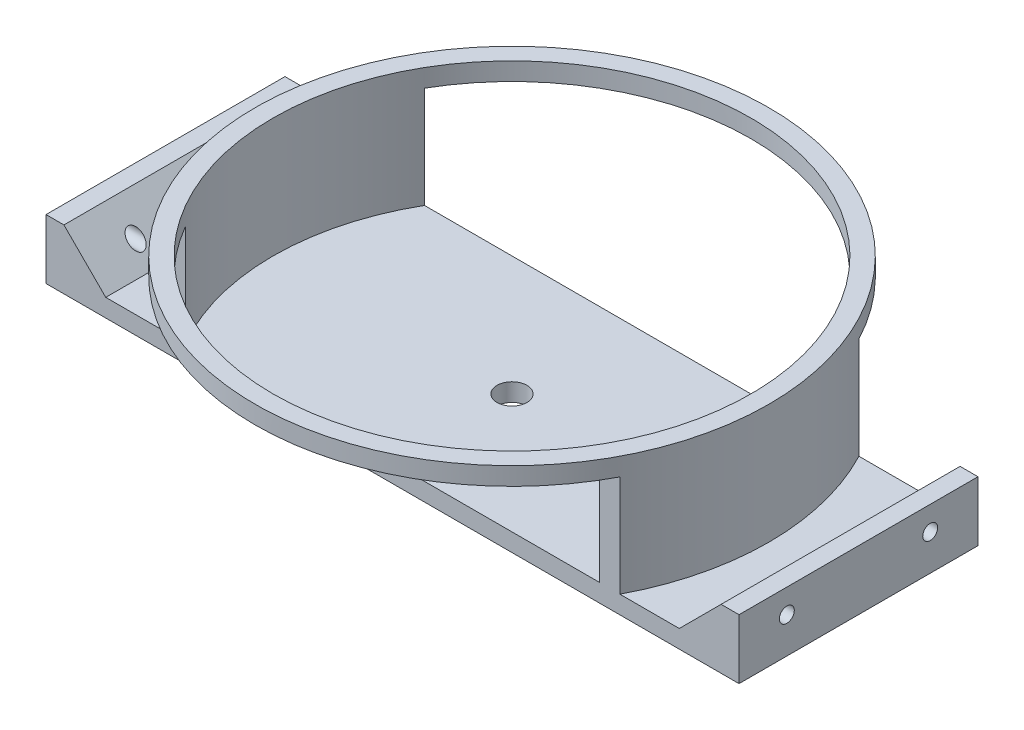
ISO-10303-21;
HEADER;
FILE_DESCRIPTION(('STEP AP214'),'2;1');
FILE_NAME('part.step','',(''),(''),'','','');
FILE_SCHEMA(('AUTOMOTIVE_DESIGN { 1 0 10303 214 1 1 1 1 }'));
ENDSEC;
DATA;
#1=APPLICATION_CONTEXT('core data for automotive mechanical design processes');
#2=APPLICATION_PROTOCOL_DEFINITION('international standard','automotive_design',2000,#1);
#3=PRODUCT_CONTEXT('',#1,'mechanical');
#4=PRODUCT('Part','Part','',(#3));
#5=PRODUCT_RELATED_PRODUCT_CATEGORY('part','',(#4));
#6=PRODUCT_DEFINITION_FORMATION('','',#4);
#7=PRODUCT_DEFINITION_CONTEXT('part definition',#1,'design');
#8=PRODUCT_DEFINITION('design','',#6,#7);
#9=PRODUCT_DEFINITION_SHAPE('','',#8);
#10=(LENGTH_UNIT() NAMED_UNIT(*) SI_UNIT(.MILLI.,.METRE.));
#11=(NAMED_UNIT(*) PLANE_ANGLE_UNIT() SI_UNIT($,.RADIAN.));
#12=(NAMED_UNIT(*) SI_UNIT($,.STERADIAN.) SOLID_ANGLE_UNIT());
#13=UNCERTAINTY_MEASURE_WITH_UNIT(LENGTH_MEASURE(1.E-05),#10,'distance_accuracy_value','');
#14=(GEOMETRIC_REPRESENTATION_CONTEXT(3) GLOBAL_UNCERTAINTY_ASSIGNED_CONTEXT((#13)) GLOBAL_UNIT_ASSIGNED_CONTEXT((#10,
#11,#12)) REPRESENTATION_CONTEXT('',''));
#15=CARTESIAN_POINT('',(0.,0.,0.));
#16=DIRECTION('',(0.,0.,1.));
#17=DIRECTION('',(1.,0.,0.));
#18=AXIS2_PLACEMENT_3D('',#15,#16,#17);
#19=CARTESIAN_POINT('',(0.,3.,0.));
#20=DIRECTION('',(0.,1.,0.));
#21=DIRECTION('',(0.,0.,1.));
#22=AXIS2_PLACEMENT_3D('',#19,#20,#21);
#23=PLANE('',#22);
#24=DIRECTION('',(-1.,0.,0.));
#25=VECTOR('',#24,1.);
#26=CARTESIAN_POINT('',(-58.,3.,-20.));
#27=LINE('',#26,#25);
#28=CARTESIAN_POINT('',(48.,3.,-20.));
#29=VERTEX_POINT('',#28);
#30=CARTESIAN_POINT('',(38.0657326213486,3.,-20.));
#31=VERTEX_POINT('',#30);
#32=EDGE_CURVE('E71',#29,#31,#27,.T.);
#33=ORIENTED_EDGE('',*,*,#32,.T.);
#34=CARTESIAN_POINT('',(0.,3.,0.));
#35=DIRECTION('',(0.,1.,0.));
#36=DIRECTION('',(0.,0.,1.));
#37=AXIS2_PLACEMENT_3D('',#34,#35,#36);
#38=CIRCLE('',#37,43.);
#39=CARTESIAN_POINT('',(38.0657326213486,3.,20.));
#40=VERTEX_POINT('',#39);
#41=EDGE_CURVE('E179',#40,#31,#38,.T.);
#42=ORIENTED_EDGE('',*,*,#41,.F.);
#43=DIRECTION('',(1.,0.,0.));
#44=VECTOR('',#43,1.);
#45=CARTESIAN_POINT('',(-58.,3.,20.));
#46=LINE('',#45,#44);
#47=CARTESIAN_POINT('',(48.,3.,20.));
#48=VERTEX_POINT('',#47);
#49=EDGE_CURVE('E278',#40,#48,#46,.T.);
#50=ORIENTED_EDGE('',*,*,#49,.T.);
#51=DIRECTION('',(0.,0.,-1.));
#52=VECTOR('',#51,1.);
#53=CARTESIAN_POINT('',(48.,3.,0.));
#54=LINE('',#53,#52);
#55=EDGE_CURVE('E304',#48,#29,#54,.T.);
#56=ORIENTED_EDGE('',*,*,#55,.T.);
#57=EDGE_LOOP('',(#33,#42,#50,#56));
#58=FACE_BOUND('',#57,.T.);
#59=ADVANCED_FACE('F45',(#58),#23,.T.);
#60=CARTESIAN_POINT('',(0.,20.,0.));
#61=DIRECTION('',(0.,1.,0.));
#62=DIRECTION('',(0.,0.,1.));
#63=AXIS2_PLACEMENT_3D('',#60,#61,#62);
#64=PLANE('',#63);
#65=DIRECTION('',(1.,0.,0.));
#66=VECTOR('',#65,1.);
#67=CARTESIAN_POINT('',(0.,20.,20.));
#68=LINE('',#67,#66);
#69=CARTESIAN_POINT('',(34.6410161513775,20.,20.));
#70=VERTEX_POINT('',#69);
#71=CARTESIAN_POINT('',(38.0657326213486,20.,20.));
#72=VERTEX_POINT('',#71);
#73=EDGE_CURVE('E187',#70,#72,#68,.T.);
#74=ORIENTED_EDGE('',*,*,#73,.T.);
#75=CARTESIAN_POINT('',(0.,20.,0.));
#76=DIRECTION('',(0.,1.,0.));
#77=DIRECTION('',(1.,0.,0.));
#78=AXIS2_PLACEMENT_3D('',#75,#76,#77);
#79=CIRCLE('',#78,43.);
#80=CARTESIAN_POINT('',(-38.0657326213486,20.,20.));
#81=VERTEX_POINT('',#80);
#82=EDGE_CURVE('E171',#81,#72,#79,.T.);
#83=ORIENTED_EDGE('',*,*,#82,.F.);
#84=DIRECTION('',(1.,0.,0.));
#85=VECTOR('',#84,1.);
#86=CARTESIAN_POINT('',(0.,20.,20.));
#87=LINE('',#86,#85);
#88=CARTESIAN_POINT('',(-34.6410161513775,20.,20.));
#89=VERTEX_POINT('',#88);
#90=EDGE_CURVE('E216',#81,#89,#87,.T.);
#91=ORIENTED_EDGE('',*,*,#90,.T.);
#92=CARTESIAN_POINT('',(0.,20.,0.));
#93=DIRECTION('',(0.,1.,0.));
#94=DIRECTION('',(0.,0.,1.));
#95=AXIS2_PLACEMENT_3D('',#92,#93,#94);
#96=CIRCLE('',#95,40.);
#97=EDGE_CURVE('E201',#89,#70,#96,.T.);
#98=ORIENTED_EDGE('',*,*,#97,.T.);
#99=EDGE_LOOP('',(#74,#83,#91,#98));
#100=FACE_BOUND('',#99,.T.);
#101=ADVANCED_FACE('F339',(#100),#64,.F.);
#102=DIRECTION('',(-1.,0.,0.));
#103=VECTOR('',#102,1.);
#104=CARTESIAN_POINT('',(0.,20.,-20.));
#105=LINE('',#104,#103);
#106=CARTESIAN_POINT('',(38.0657326213486,20.,-20.));
#107=VERTEX_POINT('',#106);
#108=CARTESIAN_POINT('',(34.6410161513775,20.,-20.));
#109=VERTEX_POINT('',#108);
#110=EDGE_CURVE('E164',#107,#109,#105,.T.);
#111=ORIENTED_EDGE('',*,*,#110,.T.);
#112=CARTESIAN_POINT('',(-34.6410161513775,20.,-20.));
#113=VERTEX_POINT('',#112);
#114=EDGE_CURVE('E190',#109,#113,#96,.T.);
#115=ORIENTED_EDGE('',*,*,#114,.T.);
#116=DIRECTION('',(-1.,0.,0.));
#117=VECTOR('',#116,1.);
#118=CARTESIAN_POINT('',(0.,20.,-20.));
#119=LINE('',#118,#117);
#120=CARTESIAN_POINT('',(-38.0657326213486,20.,-20.));
#121=VERTEX_POINT('',#120);
#122=EDGE_CURVE('E167',#113,#121,#119,.T.);
#123=ORIENTED_EDGE('',*,*,#122,.T.);
#124=EDGE_CURVE('E160',#107,#121,#79,.T.);
#125=ORIENTED_EDGE('',*,*,#124,.F.);
#126=EDGE_LOOP('',(#111,#115,#123,#125));
#127=FACE_BOUND('',#126,.T.);
#128=ADVANCED_FACE('F162',(#127),#64,.F.);
#129=CARTESIAN_POINT('',(-48.,3.,20.));
#130=VERTEX_POINT('',#129);
#131=CARTESIAN_POINT('',(-38.0657326213486,3.,20.));
#132=VERTEX_POINT('',#131);
#133=EDGE_CURVE('E281',#130,#132,#46,.T.);
#134=ORIENTED_EDGE('',*,*,#133,.T.);
#135=CARTESIAN_POINT('',(0.,3.,0.));
#136=DIRECTION('',(0.,1.,0.));
#137=DIRECTION('',(0.,0.,1.));
#138=AXIS2_PLACEMENT_3D('',#135,#136,#137);
#139=CIRCLE('',#138,43.);
#140=CARTESIAN_POINT('',(-38.0657326213486,3.,-20.));
#141=VERTEX_POINT('',#140);
#142=EDGE_CURVE('E207',#141,#132,#139,.T.);
#143=ORIENTED_EDGE('',*,*,#142,.F.);
#144=CARTESIAN_POINT('',(-48.0000000000001,3.,-20.));
#145=VERTEX_POINT('',#144);
#146=EDGE_CURVE('E280',#141,#145,#27,.T.);
#147=ORIENTED_EDGE('',*,*,#146,.T.);
#148=DIRECTION('',(0.,0.,1.));
#149=VECTOR('',#148,1.);
#150=CARTESIAN_POINT('',(-48.0000000000001,3.,0.));
#151=LINE('',#150,#149);
#152=EDGE_CURVE('E306',#145,#130,#151,.T.);
#153=ORIENTED_EDGE('',*,*,#152,.T.);
#154=EDGE_LOOP('',(#134,#143,#147,#153));
#155=FACE_BOUND('',#154,.T.);
#156=ADVANCED_FACE('F341',(#155),#23,.T.);
#157=CARTESIAN_POINT('',(0.,3.,0.));
#158=DIRECTION('',(0.,1.,0.));
#159=DIRECTION('',(0.,0.,1.));
#160=AXIS2_PLACEMENT_3D('',#157,#158,#159);
#161=CIRCLE('',#160,40.);
#162=CARTESIAN_POINT('',(34.6410161513775,3.,20.));
#163=VERTEX_POINT('',#162);
#164=CARTESIAN_POINT('',(34.6410161513775,3.,-20.));
#165=VERTEX_POINT('',#164);
#166=EDGE_CURVE('E63',#163,#165,#161,.T.);
#167=ORIENTED_EDGE('',*,*,#166,.T.);
#168=CARTESIAN_POINT('',(-34.6410161513775,3.,-20.));
#169=VERTEX_POINT('',#168);
#170=EDGE_CURVE('E279',#165,#169,#27,.T.);
#171=ORIENTED_EDGE('',*,*,#170,.T.);
#172=CARTESIAN_POINT('',(0.,3.,0.));
#173=DIRECTION('',(0.,1.,0.));
#174=DIRECTION('',(0.,0.,1.));
#175=AXIS2_PLACEMENT_3D('',#172,#173,#174);
#176=CIRCLE('',#175,40.);
#177=CARTESIAN_POINT('',(-34.6410161513775,3.,20.));
#178=VERTEX_POINT('',#177);
#179=EDGE_CURVE('E212',#169,#178,#176,.T.);
#180=ORIENTED_EDGE('',*,*,#179,.T.);
#181=EDGE_CURVE('E284',#178,#163,#46,.T.);
#182=ORIENTED_EDGE('',*,*,#181,.T.);
#183=EDGE_LOOP('',(#167,#171,#180,#182));
#184=FACE_BOUND('',#183,.T.);
#185=CARTESIAN_POINT('',(0.,3.,0.));
#186=DIRECTION('',(0.,1.,0.));
#187=DIRECTION('',(0.,0.,1.));
#188=AXIS2_PLACEMENT_3D('',#185,#186,#187);
#189=CIRCLE('',#188,2.5);
#190=CARTESIAN_POINT('',(0.,3.,2.5));
#191=VERTEX_POINT('',#190);
#192=EDGE_CURVE('E270',#191,#191,#189,.T.);
#193=ORIENTED_EDGE('',*,*,#192,.F.);
#194=EDGE_LOOP('',(#193));
#195=FACE_BOUND('',#194,.T.);
#196=ADVANCED_FACE('F342',(#184,#195),#23,.T.);
#197=CARTESIAN_POINT('',(58.,3.,-20.));
#198=DIRECTION('',(-1.,0.,0.));
#199=DIRECTION('',(0.,0.,1.));
#200=AXIS2_PLACEMENT_3D('',#197,#198,#199);
#201=PLANE('',#200);
#202=CARTESIAN_POINT('',(58.,6.,-12.));
#203=DIRECTION('',(-1.,0.,0.));
#204=DIRECTION('',(0.,0.,1.));
#205=AXIS2_PLACEMENT_3D('',#202,#203,#204);
#206=CIRCLE('',#205,1.25);
#207=CARTESIAN_POINT('',(58.,6.,-10.75));
#208=VERTEX_POINT('',#207);
#209=EDGE_CURVE('E228',#208,#208,#206,.T.);
#210=ORIENTED_EDGE('',*,*,#209,.T.);
#211=EDGE_LOOP('',(#210));
#212=FACE_BOUND('',#211,.T.);
#213=CARTESIAN_POINT('',(58.,6.,12.));
#214=DIRECTION('',(-1.,0.,0.));
#215=DIRECTION('',(0.,0.,1.));
#216=AXIS2_PLACEMENT_3D('',#213,#214,#215);
#217=CIRCLE('',#216,1.25);
#218=CARTESIAN_POINT('',(58.,6.,13.25));
#219=VERTEX_POINT('',#218);
#220=EDGE_CURVE('E219',#219,#219,#217,.T.);
#221=ORIENTED_EDGE('',*,*,#220,.T.);
#222=EDGE_LOOP('',(#221));
#223=FACE_BOUND('',#222,.T.);
#224=DIRECTION('',(0.,0.,-1.));
#225=VECTOR('',#224,1.);
#226=CARTESIAN_POINT('',(58.,0.,-20.));
#227=LINE('',#226,#225);
#228=CARTESIAN_POINT('',(58.,0.,20.));
#229=VERTEX_POINT('',#228);
#230=CARTESIAN_POINT('',(58.,0.,-20.));
#231=VERTEX_POINT('',#230);
#232=EDGE_CURVE('E274',#229,#231,#227,.T.);
#233=ORIENTED_EDGE('',*,*,#232,.T.);
#234=DIRECTION('',(0.,-1.,0.));
#235=VECTOR('',#234,1.);
#236=CARTESIAN_POINT('',(58.,3.,-20.));
#237=LINE('',#236,#235);
#238=CARTESIAN_POINT('',(58.,10.,-20.));
#239=VERTEX_POINT('',#238);
#240=EDGE_CURVE('E301',#239,#231,#237,.T.);
#241=ORIENTED_EDGE('',*,*,#240,.F.);
#242=DIRECTION('',(0.,0.,-1.));
#243=VECTOR('',#242,1.);
#244=CARTESIAN_POINT('',(58.,10.,-20.));
#245=LINE('',#244,#243);
#246=CARTESIAN_POINT('',(58.,10.,20.));
#247=VERTEX_POINT('',#246);
#248=EDGE_CURVE('E246',#247,#239,#245,.T.);
#249=ORIENTED_EDGE('',*,*,#248,.F.);
#250=DIRECTION('',(0.,-1.,0.));
#251=VECTOR('',#250,1.);
#252=CARTESIAN_POINT('',(58.,3.,20.));
#253=LINE('',#252,#251);
#254=EDGE_CURVE('E283',#247,#229,#253,.T.);
#255=ORIENTED_EDGE('',*,*,#254,.T.);
#256=EDGE_LOOP('',(#233,#241,#249,#255));
#257=FACE_BOUND('',#256,.T.);
#258=ADVANCED_FACE('F355',(#212,#223,#257),#201,.F.);
#259=CARTESIAN_POINT('',(-58.,3.,-20.));
#260=DIRECTION('',(0.,0.,1.));
#261=DIRECTION('',(1.,0.,0.));
#262=AXIS2_PLACEMENT_3D('',#259,#260,#261);
#263=PLANE('',#262);
#264=DIRECTION('',(-1.,0.,0.));
#265=VECTOR('',#264,1.);
#266=CARTESIAN_POINT('',(-58.,0.,-20.));
#267=LINE('',#266,#265);
#268=CARTESIAN_POINT('',(-58.,0.,-20.));
#269=VERTEX_POINT('',#268);
#270=EDGE_CURVE('E287',#231,#269,#267,.T.);
#271=ORIENTED_EDGE('',*,*,#270,.T.);
#272=DIRECTION('',(0.,-1.,0.));
#273=VECTOR('',#272,1.);
#274=CARTESIAN_POINT('',(-58.,3.,-20.));
#275=LINE('',#274,#273);
#276=CARTESIAN_POINT('',(-58.,10.,-20.));
#277=VERTEX_POINT('',#276);
#278=EDGE_CURVE('E298',#277,#269,#275,.T.);
#279=ORIENTED_EDGE('',*,*,#278,.F.);
#280=DIRECTION('',(-1.,0.,0.));
#281=VECTOR('',#280,1.);
#282=CARTESIAN_POINT('',(-58.,10.,-20.));
#283=LINE('',#282,#281);
#284=CARTESIAN_POINT('',(-55.,10.,-20.));
#285=VERTEX_POINT('',#284);
#286=EDGE_CURVE('E267',#285,#277,#283,.T.);
#287=ORIENTED_EDGE('',*,*,#286,.F.);
#288=DIRECTION('',(0.707106781186546,-0.707106781186549,0.));
#289=VECTOR('',#288,1.);
#290=CARTESIAN_POINT('',(-53.,7.99999999999998,-20.));
#291=LINE('',#290,#289);
#292=EDGE_CURVE('E308',#285,#145,#291,.T.);
#293=ORIENTED_EDGE('',*,*,#292,.T.);
#294=ORIENTED_EDGE('',*,*,#146,.F.);
#295=DIRECTION('',(0.,-1.,0.));
#296=VECTOR('',#295,1.);
#297=CARTESIAN_POINT('',(-38.0657326213486,60.8640748210642,-20.));
#298=LINE('',#297,#296);
#299=EDGE_CURVE('E211',#121,#141,#298,.T.);
#300=ORIENTED_EDGE('',*,*,#299,.F.);
#301=ORIENTED_EDGE('',*,*,#122,.F.);
#302=DIRECTION('',(0.,-1.,0.));
#303=VECTOR('',#302,1.);
#304=CARTESIAN_POINT('',(-34.6410161513775,60.8640748210642,-20.));
#305=LINE('',#304,#303);
#306=EDGE_CURVE('E220',#113,#169,#305,.T.);
#307=ORIENTED_EDGE('',*,*,#306,.T.);
#308=ORIENTED_EDGE('',*,*,#170,.F.);
#309=DIRECTION('',(0.,-1.,0.));
#310=VECTOR('',#309,1.);
#311=CARTESIAN_POINT('',(34.6410161513775,60.8640748210642,-20.));
#312=LINE('',#311,#310);
#313=EDGE_CURVE('E185',#109,#165,#312,.T.);
#314=ORIENTED_EDGE('',*,*,#313,.F.);
#315=ORIENTED_EDGE('',*,*,#110,.F.);
#316=DIRECTION('',(0.,-1.,0.));
#317=VECTOR('',#316,1.);
#318=CARTESIAN_POINT('',(38.0657326213486,60.8640748210642,-20.));
#319=LINE('',#318,#317);
#320=EDGE_CURVE('E175',#107,#31,#319,.T.);
#321=ORIENTED_EDGE('',*,*,#320,.T.);
#322=ORIENTED_EDGE('',*,*,#32,.F.);
#323=DIRECTION('',(0.707106781186546,0.707106781186549,0.));
#324=VECTOR('',#323,1.);
#325=CARTESIAN_POINT('',(-4.99999999999974,-50.,-20.));
#326=LINE('',#325,#324);
#327=CARTESIAN_POINT('',(55.,10.,-20.));
#328=VERTEX_POINT('',#327);
#329=EDGE_CURVE('E12',#29,#328,#326,.T.);
#330=ORIENTED_EDGE('',*,*,#329,.T.);
#331=DIRECTION('',(-1.,0.,0.));
#332=VECTOR('',#331,1.);
#333=CARTESIAN_POINT('',(58.,10.,-20.));
#334=LINE('',#333,#332);
#335=EDGE_CURVE('E249',#239,#328,#334,.T.);
#336=ORIENTED_EDGE('',*,*,#335,.F.);
#337=ORIENTED_EDGE('',*,*,#240,.T.);
#338=EDGE_LOOP('',(#271,#279,#287,#293,#294,#300,#301,#307,#308,#314,#315,#321,#322,#330,#336,#337));
#339=FACE_BOUND('',#338,.T.);
#340=ADVANCED_FACE('F183',(#339),#263,.F.);
#341=CARTESIAN_POINT('',(-58.,3.,-20.));
#342=DIRECTION('',(1.,0.,0.));
#343=DIRECTION('',(0.,0.,-1.));
#344=AXIS2_PLACEMENT_3D('',#341,#342,#343);
#345=PLANE('',#344);
#346=CARTESIAN_POINT('',(-58.,6.,-12.));
#347=DIRECTION('',(1.,0.,0.));
#348=DIRECTION('',(0.,0.,-1.));
#349=AXIS2_PLACEMENT_3D('',#346,#347,#348);
#350=CIRCLE('',#349,1.25);
#351=CARTESIAN_POINT('',(-58.,6.,-13.25));
#352=VERTEX_POINT('',#351);
#353=EDGE_CURVE('E243',#352,#352,#350,.T.);
#354=ORIENTED_EDGE('',*,*,#353,.T.);
#355=EDGE_LOOP('',(#354));
#356=FACE_BOUND('',#355,.T.);
#357=CARTESIAN_POINT('',(-58.,6.,12.));
#358=DIRECTION('',(1.,0.,0.));
#359=DIRECTION('',(0.,0.,-1.));
#360=AXIS2_PLACEMENT_3D('',#357,#358,#359);
#361=CIRCLE('',#360,1.25);
#362=CARTESIAN_POINT('',(-58.,6.,10.75));
#363=VERTEX_POINT('',#362);
#364=EDGE_CURVE('E237',#363,#363,#361,.T.);
#365=ORIENTED_EDGE('',*,*,#364,.T.);
#366=EDGE_LOOP('',(#365));
#367=FACE_BOUND('',#366,.T.);
#368=DIRECTION('',(0.,0.,1.));
#369=VECTOR('',#368,1.);
#370=CARTESIAN_POINT('',(-58.,0.,-20.));
#371=LINE('',#370,#369);
#372=CARTESIAN_POINT('',(-58.,0.,20.));
#373=VERTEX_POINT('',#372);
#374=EDGE_CURVE('E289',#269,#373,#371,.T.);
#375=ORIENTED_EDGE('',*,*,#374,.T.);
#376=DIRECTION('',(0.,-1.,0.));
#377=VECTOR('',#376,1.);
#378=CARTESIAN_POINT('',(-58.,3.,20.));
#379=LINE('',#378,#377);
#380=CARTESIAN_POINT('',(-58.,10.,20.));
#381=VERTEX_POINT('',#380);
#382=EDGE_CURVE('E295',#381,#373,#379,.T.);
#383=ORIENTED_EDGE('',*,*,#382,.F.);
#384=DIRECTION('',(0.,0.,1.));
#385=VECTOR('',#384,1.);
#386=CARTESIAN_POINT('',(-58.,10.,-20.));
#387=LINE('',#386,#385);
#388=EDGE_CURVE('E258',#277,#381,#387,.T.);
#389=ORIENTED_EDGE('',*,*,#388,.F.);
#390=ORIENTED_EDGE('',*,*,#278,.T.);
#391=EDGE_LOOP('',(#375,#383,#389,#390));
#392=FACE_BOUND('',#391,.T.);
#393=ADVANCED_FACE('F402',(#356,#367,#392),#345,.F.);
#394=CARTESIAN_POINT('',(-58.,3.,20.));
#395=DIRECTION('',(0.,0.,-1.));
#396=DIRECTION('',(-1.,0.,0.));
#397=AXIS2_PLACEMENT_3D('',#394,#395,#396);
#398=PLANE('',#397);
#399=DIRECTION('',(1.,0.,0.));
#400=VECTOR('',#399,1.);
#401=CARTESIAN_POINT('',(-58.,0.,20.));
#402=LINE('',#401,#400);
#403=EDGE_CURVE('E291',#373,#229,#402,.T.);
#404=ORIENTED_EDGE('',*,*,#403,.T.);
#405=ORIENTED_EDGE('',*,*,#254,.F.);
#406=DIRECTION('',(1.,0.,0.));
#407=VECTOR('',#406,1.);
#408=CARTESIAN_POINT('',(58.,10.,20.));
#409=LINE('',#408,#407);
#410=CARTESIAN_POINT('',(55.,10.,20.));
#411=VERTEX_POINT('',#410);
#412=EDGE_CURVE('E255',#411,#247,#409,.T.);
#413=ORIENTED_EDGE('',*,*,#412,.F.);
#414=DIRECTION('',(-0.707106781186546,-0.707106781186549,0.));
#415=VECTOR('',#414,1.);
#416=CARTESIAN_POINT('',(-4.99999999999973,-50.,20.));
#417=LINE('',#416,#415);
#418=EDGE_CURVE('E55',#411,#48,#417,.T.);
#419=ORIENTED_EDGE('',*,*,#418,.T.);
#420=ORIENTED_EDGE('',*,*,#49,.F.);
#421=DIRECTION('',(0.,-1.,0.));
#422=VECTOR('',#421,1.);
#423=CARTESIAN_POINT('',(38.0657326213486,60.8640748210642,20.));
#424=LINE('',#423,#422);
#425=EDGE_CURVE('E198',#72,#40,#424,.T.);
#426=ORIENTED_EDGE('',*,*,#425,.F.);
#427=ORIENTED_EDGE('',*,*,#73,.F.);
#428=DIRECTION('',(0.,-1.,0.));
#429=VECTOR('',#428,1.);
#430=CARTESIAN_POINT('',(34.6410161513775,60.8640748210642,20.));
#431=LINE('',#430,#429);
#432=EDGE_CURVE('E195',#70,#163,#431,.T.);
#433=ORIENTED_EDGE('',*,*,#432,.T.);
#434=ORIENTED_EDGE('',*,*,#181,.F.);
#435=DIRECTION('',(0.,-1.,0.));
#436=VECTOR('',#435,1.);
#437=CARTESIAN_POINT('',(-34.6410161513775,60.8640748210642,20.));
#438=LINE('',#437,#436);
#439=EDGE_CURVE('E204',#89,#178,#438,.T.);
#440=ORIENTED_EDGE('',*,*,#439,.F.);
#441=ORIENTED_EDGE('',*,*,#90,.F.);
#442=DIRECTION('',(0.,-1.,0.));
#443=VECTOR('',#442,1.);
#444=CARTESIAN_POINT('',(-38.0657326213486,60.8640748210642,20.));
#445=LINE('',#444,#443);
#446=EDGE_CURVE('E210',#81,#132,#445,.T.);
#447=ORIENTED_EDGE('',*,*,#446,.T.);
#448=ORIENTED_EDGE('',*,*,#133,.F.);
#449=DIRECTION('',(-0.707106781186546,0.707106781186549,0.));
#450=VECTOR('',#449,1.);
#451=CARTESIAN_POINT('',(-53.,7.99999999999998,20.));
#452=LINE('',#451,#450);
#453=CARTESIAN_POINT('',(-55.,10.,20.));
#454=VERTEX_POINT('',#453);
#455=EDGE_CURVE('E311',#130,#454,#452,.T.);
#456=ORIENTED_EDGE('',*,*,#455,.T.);
#457=DIRECTION('',(1.,0.,0.));
#458=VECTOR('',#457,1.);
#459=CARTESIAN_POINT('',(-58.,10.,20.));
#460=LINE('',#459,#458);
#461=EDGE_CURVE('E261',#381,#454,#460,.T.);
#462=ORIENTED_EDGE('',*,*,#461,.F.);
#463=ORIENTED_EDGE('',*,*,#382,.T.);
#464=EDGE_LOOP('',(#404,#405,#413,#419,#420,#426,#427,#433,#434,#440,#441,#447,#448,#456,#462,#463));
#465=FACE_BOUND('',#464,.T.);
#466=ADVANCED_FACE('F377',(#465),#398,.F.);
#467=CARTESIAN_POINT('',(0.,0.,0.));
#468=DIRECTION('',(0.,1.,0.));
#469=DIRECTION('',(0.,0.,1.));
#470=AXIS2_PLACEMENT_3D('',#467,#468,#469);
#471=PLANE('',#470);
#472=CARTESIAN_POINT('',(0.,0.,0.));
#473=DIRECTION('',(0.,1.,0.));
#474=DIRECTION('',(0.,0.,1.));
#475=AXIS2_PLACEMENT_3D('',#472,#473,#474);
#476=CIRCLE('',#475,2.5);
#477=CARTESIAN_POINT('',(0.,0.,2.5));
#478=VERTEX_POINT('',#477);
#479=EDGE_CURVE('E271',#478,#478,#476,.T.);
#480=ORIENTED_EDGE('',*,*,#479,.T.);
#481=EDGE_LOOP('',(#480));
#482=FACE_BOUND('',#481,.T.);
#483=ORIENTED_EDGE('',*,*,#232,.F.);
#484=ORIENTED_EDGE('',*,*,#403,.F.);
#485=ORIENTED_EDGE('',*,*,#374,.F.);
#486=ORIENTED_EDGE('',*,*,#270,.F.);
#487=EDGE_LOOP('',(#483,#484,#485,#486));
#488=FACE_BOUND('',#487,.T.);
#489=ADVANCED_FACE('F368',(#482,#488),#471,.F.);
#490=CARTESIAN_POINT('',(0.,0.,0.));
#491=DIRECTION('',(0.,1.,0.));
#492=DIRECTION('',(0.,0.,1.));
#493=AXIS2_PLACEMENT_3D('',#490,#491,#492);
#494=CYLINDRICAL_SURFACE('',#493,2.5);
#495=ORIENTED_EDGE('',*,*,#479,.F.);
#496=EDGE_LOOP('',(#495));
#497=FACE_BOUND('',#496,.T.);
#498=ORIENTED_EDGE('',*,*,#192,.T.);
#499=EDGE_LOOP('',(#498));
#500=FACE_BOUND('',#499,.T.);
#501=ADVANCED_FACE('F365',(#497,#500),#494,.F.);
#502=CARTESIAN_POINT('',(0.,10.,0.));
#503=DIRECTION('',(0.,1.,0.));
#504=DIRECTION('',(0.,0.,1.));
#505=AXIS2_PLACEMENT_3D('',#502,#503,#504);
#506=PLANE('',#505);
#507=ORIENTED_EDGE('',*,*,#388,.T.);
#508=ORIENTED_EDGE('',*,*,#461,.T.);
#509=DIRECTION('',(0.,0.,-1.));
#510=VECTOR('',#509,1.);
#511=CARTESIAN_POINT('',(-55.,10.,-20.));
#512=LINE('',#511,#510);
#513=EDGE_CURVE('E264',#454,#285,#512,.T.);
#514=ORIENTED_EDGE('',*,*,#513,.T.);
#515=ORIENTED_EDGE('',*,*,#286,.T.);
#516=EDGE_LOOP('',(#507,#508,#514,#515));
#517=FACE_BOUND('',#516,.T.);
#518=ADVANCED_FACE('F367',(#517),#506,.T.);
#519=CARTESIAN_POINT('',(0.,10.,0.));
#520=DIRECTION('',(0.,-1.,0.));
#521=DIRECTION('',(0.,0.,-1.));
#522=AXIS2_PLACEMENT_3D('',#519,#520,#521);
#523=PLANE('',#522);
#524=ORIENTED_EDGE('',*,*,#248,.T.);
#525=ORIENTED_EDGE('',*,*,#335,.T.);
#526=DIRECTION('',(0.,0.,1.));
#527=VECTOR('',#526,1.);
#528=CARTESIAN_POINT('',(55.,10.,-20.));
#529=LINE('',#528,#527);
#530=EDGE_CURVE('E252',#328,#411,#529,.T.);
#531=ORIENTED_EDGE('',*,*,#530,.T.);
#532=ORIENTED_EDGE('',*,*,#412,.T.);
#533=EDGE_LOOP('',(#524,#525,#531,#532));
#534=FACE_BOUND('',#533,.T.);
#535=ADVANCED_FACE('F374',(#534),#523,.F.);
#536=CARTESIAN_POINT('',(-55.,10.,-20.));
#537=DIRECTION('',(-0.707106781186549,-0.707106781186546,0.));
#538=DIRECTION('',(0.,0.,-1.));
#539=AXIS2_PLACEMENT_3D('',#536,#537,#538);
#540=PLANE('',#539);
#541=CARTESIAN_POINT('',(-51.,6.,-12.));
#542=DIRECTION('',(-0.707106781186549,-0.707106781186546,0.));
#543=DIRECTION('',(-0.707106781186546,0.707106781186549,0.));
#544=AXIS2_PLACEMENT_3D('',#541,#542,#543);
#545=ELLIPSE('',#544,1.76776695296636,1.25);
#546=CARTESIAN_POINT('',(-52.25,7.25,-12.));
#547=VERTEX_POINT('',#546);
#548=EDGE_CURVE('E240',#547,#547,#545,.T.);
#549=ORIENTED_EDGE('',*,*,#548,.T.);
#550=EDGE_LOOP('',(#549));
#551=FACE_BOUND('',#550,.T.);
#552=CARTESIAN_POINT('',(-51.0000000000001,6.,12.));
#553=DIRECTION('',(-0.707106781186549,-0.707106781186546,0.));
#554=DIRECTION('',(-0.707106781186546,0.707106781186549,0.));
#555=AXIS2_PLACEMENT_3D('',#552,#553,#554);
#556=ELLIPSE('',#555,1.76776695296636,1.25);
#557=CARTESIAN_POINT('',(-52.2500000000001,7.25,12.));
#558=VERTEX_POINT('',#557);
#559=EDGE_CURVE('E234',#558,#558,#556,.T.);
#560=ORIENTED_EDGE('',*,*,#559,.T.);
#561=EDGE_LOOP('',(#560));
#562=FACE_BOUND('',#561,.T.);
#563=ORIENTED_EDGE('',*,*,#455,.F.);
#564=ORIENTED_EDGE('',*,*,#152,.F.);
#565=ORIENTED_EDGE('',*,*,#292,.F.);
#566=ORIENTED_EDGE('',*,*,#513,.F.);
#567=EDGE_LOOP('',(#563,#564,#565,#566));
#568=FACE_BOUND('',#567,.T.);
#569=ADVANCED_FACE('F332',(#551,#562,#568),#540,.F.);
#570=CARTESIAN_POINT('',(55.,10.,-20.));
#571=DIRECTION('',(0.707106781186549,-0.707106781186546,0.));
#572=DIRECTION('',(0.,0.,1.));
#573=AXIS2_PLACEMENT_3D('',#570,#571,#572);
#574=PLANE('',#573);
#575=CARTESIAN_POINT('',(51.,6.,-12.));
#576=DIRECTION('',(0.707106781186549,-0.707106781186546,0.));
#577=DIRECTION('',(-0.707106781186546,-0.707106781186549,0.));
#578=AXIS2_PLACEMENT_3D('',#575,#576,#577);
#579=ELLIPSE('',#578,1.76776695296636,1.25);
#580=CARTESIAN_POINT('',(49.75,4.75,-12.));
#581=VERTEX_POINT('',#580);
#582=EDGE_CURVE('E50',#581,#581,#579,.T.);
#583=ORIENTED_EDGE('',*,*,#582,.T.);
#584=EDGE_LOOP('',(#583));
#585=FACE_BOUND('',#584,.T.);
#586=CARTESIAN_POINT('',(51.,6.,12.));
#587=DIRECTION('',(0.707106781186549,-0.707106781186546,0.));
#588=DIRECTION('',(-0.707106781186546,-0.707106781186549,0.));
#589=AXIS2_PLACEMENT_3D('',#586,#587,#588);
#590=ELLIPSE('',#589,1.76776695296636,1.25);
#591=CARTESIAN_POINT('',(49.75,4.75,12.));
#592=VERTEX_POINT('',#591);
#593=EDGE_CURVE('E231',#592,#592,#590,.T.);
#594=ORIENTED_EDGE('',*,*,#593,.T.);
#595=EDGE_LOOP('',(#594));
#596=FACE_BOUND('',#595,.T.);
#597=ORIENTED_EDGE('',*,*,#329,.F.);
#598=ORIENTED_EDGE('',*,*,#55,.F.);
#599=ORIENTED_EDGE('',*,*,#418,.F.);
#600=ORIENTED_EDGE('',*,*,#530,.F.);
#601=EDGE_LOOP('',(#597,#598,#599,#600));
#602=FACE_BOUND('',#601,.T.);
#603=ADVANCED_FACE('F48',(#585,#596,#602),#574,.F.);
#604=CARTESIAN_POINT('',(58.,6.,12.));
#605=DIRECTION('',(-1.,0.,0.));
#606=DIRECTION('',(0.,0.,1.));
#607=AXIS2_PLACEMENT_3D('',#604,#605,#606);
#608=CYLINDRICAL_SURFACE('',#607,1.25);
#609=ORIENTED_EDGE('',*,*,#220,.F.);
#610=EDGE_LOOP('',(#609));
#611=FACE_BOUND('',#610,.T.);
#612=ORIENTED_EDGE('',*,*,#593,.F.);
#613=EDGE_LOOP('',(#612));
#614=FACE_BOUND('',#613,.T.);
#615=ADVANCED_FACE('F319',(#611,#614),#608,.F.);
#616=CARTESIAN_POINT('',(58.,6.,-12.));
#617=DIRECTION('',(-1.,0.,0.));
#618=DIRECTION('',(0.,0.,1.));
#619=AXIS2_PLACEMENT_3D('',#616,#617,#618);
#620=CYLINDRICAL_SURFACE('',#619,1.25);
#621=ORIENTED_EDGE('',*,*,#209,.F.);
#622=EDGE_LOOP('',(#621));
#623=FACE_BOUND('',#622,.T.);
#624=ORIENTED_EDGE('',*,*,#582,.F.);
#625=EDGE_LOOP('',(#624));
#626=FACE_BOUND('',#625,.T.);
#627=ADVANCED_FACE('F321',(#623,#626),#620,.F.);
#628=ORIENTED_EDGE('',*,*,#559,.F.);
#629=EDGE_LOOP('',(#628));
#630=FACE_BOUND('',#629,.T.);
#631=ORIENTED_EDGE('',*,*,#364,.F.);
#632=EDGE_LOOP('',(#631));
#633=FACE_BOUND('',#632,.T.);
#634=ADVANCED_FACE('F324',(#630,#633),#608,.F.);
#635=ORIENTED_EDGE('',*,*,#548,.F.);
#636=EDGE_LOOP('',(#635));
#637=FACE_BOUND('',#636,.T.);
#638=ORIENTED_EDGE('',*,*,#353,.F.);
#639=EDGE_LOOP('',(#638));
#640=FACE_BOUND('',#639,.T.);
#641=ADVANCED_FACE('F331',(#637,#640),#620,.F.);
#642=CARTESIAN_POINT('',(0.,60.8640748210642,0.));
#643=DIRECTION('',(0.,-1.,0.));
#644=DIRECTION('',(0.,0.,-1.));
#645=AXIS2_PLACEMENT_3D('',#642,#643,#644);
#646=CYLINDRICAL_SURFACE('',#645,40.);
#647=ORIENTED_EDGE('',*,*,#306,.F.);
#648=ORIENTED_EDGE('',*,*,#114,.F.);
#649=ORIENTED_EDGE('',*,*,#313,.T.);
#650=ORIENTED_EDGE('',*,*,#166,.F.);
#651=ORIENTED_EDGE('',*,*,#432,.F.);
#652=ORIENTED_EDGE('',*,*,#97,.F.);
#653=ORIENTED_EDGE('',*,*,#439,.T.);
#654=ORIENTED_EDGE('',*,*,#179,.F.);
#655=EDGE_LOOP('',(#647,#648,#649,#650,#651,#652,#653,#654));
#656=FACE_BOUND('',#655,.T.);
#657=CARTESIAN_POINT('',(0.,23.,0.));
#658=DIRECTION('',(0.,1.,0.));
#659=DIRECTION('',(0.,0.,1.));
#660=AXIS2_PLACEMENT_3D('',#657,#658,#659);
#661=CIRCLE('',#660,40.);
#662=CARTESIAN_POINT('',(0.,23.,40.));
#663=VERTEX_POINT('',#662);
#664=EDGE_CURVE('E186',#663,#663,#661,.T.);
#665=ORIENTED_EDGE('',*,*,#664,.T.);
#666=EDGE_LOOP('',(#665));
#667=FACE_BOUND('',#666,.T.);
#668=ADVANCED_FACE('F414',(#656,#667),#646,.F.);
#669=CARTESIAN_POINT('',(0.,60.8640748210642,0.));
#670=DIRECTION('',(0.,-1.,0.));
#671=DIRECTION('',(0.,0.,-1.));
#672=AXIS2_PLACEMENT_3D('',#669,#670,#671);
#673=CYLINDRICAL_SURFACE('',#672,43.);
#674=ORIENTED_EDGE('',*,*,#446,.F.);
#675=ORIENTED_EDGE('',*,*,#82,.T.);
#676=ORIENTED_EDGE('',*,*,#425,.T.);
#677=ORIENTED_EDGE('',*,*,#41,.T.);
#678=ORIENTED_EDGE('',*,*,#320,.F.);
#679=ORIENTED_EDGE('',*,*,#124,.T.);
#680=ORIENTED_EDGE('',*,*,#299,.T.);
#681=ORIENTED_EDGE('',*,*,#142,.T.);
#682=EDGE_LOOP('',(#674,#675,#676,#677,#678,#679,#680,#681));
#683=FACE_BOUND('',#682,.T.);
#684=CARTESIAN_POINT('',(0.,23.,0.));
#685=DIRECTION('',(0.,1.,0.));
#686=DIRECTION('',(1.,0.,0.));
#687=AXIS2_PLACEMENT_3D('',#684,#685,#686);
#688=CIRCLE('',#687,43.);
#689=CARTESIAN_POINT('',(43.,23.,0.));
#690=VERTEX_POINT('',#689);
#691=EDGE_CURVE('E172',#690,#690,#688,.T.);
#692=ORIENTED_EDGE('',*,*,#691,.F.);
#693=EDGE_LOOP('',(#692));
#694=FACE_BOUND('',#693,.T.);
#695=ADVANCED_FACE('F176',(#683,#694),#673,.T.);
#696=CARTESIAN_POINT('',(0.,23.,0.));
#697=DIRECTION('',(0.,1.,0.));
#698=DIRECTION('',(0.,0.,1.));
#699=AXIS2_PLACEMENT_3D('',#696,#697,#698);
#700=PLANE('',#699);
#701=ORIENTED_EDGE('',*,*,#664,.F.);
#702=EDGE_LOOP('',(#701));
#703=FACE_BOUND('',#702,.T.);
#704=ORIENTED_EDGE('',*,*,#691,.T.);
#705=EDGE_LOOP('',(#704));
#706=FACE_BOUND('',#705,.T.);
#707=ADVANCED_FACE('F425',(#703,#706),#700,.T.);
#708=CLOSED_SHELL('',(#59,#101,#128,#156,#196,#258,#340,#393,#466,#489,#501,#518,#535,#569,#603,
#615,#627,#634,#641,#668,#695,#707));
#709=MANIFOLD_SOLID_BREP('B2',#708);
#710=ADVANCED_BREP_SHAPE_REPRESENTATION('',(#18,#709),#14);
#711=SHAPE_DEFINITION_REPRESENTATION(#9,#710);
ENDSEC;
END-ISO-10303-21;
